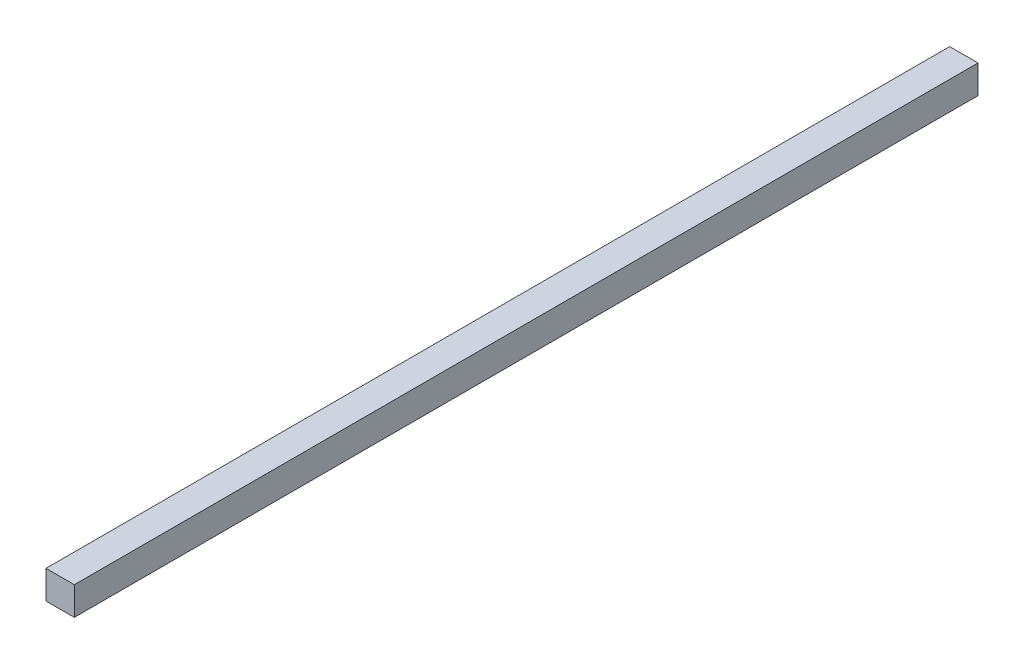
ISO-10303-21;
HEADER;
FILE_DESCRIPTION(('STEP AP214'),'2;1');
FILE_NAME('part.step','',(''),(''),'','','');
FILE_SCHEMA(('AUTOMOTIVE_DESIGN { 1 0 10303 214 1 1 1 1 }'));
ENDSEC;
DATA;
#1=APPLICATION_CONTEXT('core data for automotive mechanical design processes');
#2=APPLICATION_PROTOCOL_DEFINITION('international standard','automotive_design',2000,#1);
#3=PRODUCT_CONTEXT('',#1,'mechanical');
#4=PRODUCT('Part','Part','',(#3));
#5=PRODUCT_RELATED_PRODUCT_CATEGORY('part','',(#4));
#6=PRODUCT_DEFINITION_FORMATION('','',#4);
#7=PRODUCT_DEFINITION_CONTEXT('part definition',#1,'design');
#8=PRODUCT_DEFINITION('design','',#6,#7);
#9=PRODUCT_DEFINITION_SHAPE('','',#8);
#10=(LENGTH_UNIT() NAMED_UNIT(*) SI_UNIT(.MILLI.,.METRE.));
#11=(NAMED_UNIT(*) PLANE_ANGLE_UNIT() SI_UNIT($,.RADIAN.));
#12=(NAMED_UNIT(*) SI_UNIT($,.STERADIAN.) SOLID_ANGLE_UNIT());
#13=UNCERTAINTY_MEASURE_WITH_UNIT(LENGTH_MEASURE(1.E-05),#10,'distance_accuracy_value','');
#14=(GEOMETRIC_REPRESENTATION_CONTEXT(3) GLOBAL_UNCERTAINTY_ASSIGNED_CONTEXT((#13)) GLOBAL_UNIT_ASSIGNED_CONTEXT((#10,
#11,#12)) REPRESENTATION_CONTEXT('',''));
#15=CARTESIAN_POINT('',(0.,0.,0.));
#16=DIRECTION('',(0.,0.,1.));
#17=DIRECTION('',(1.,0.,0.));
#18=AXIS2_PLACEMENT_3D('',#15,#16,#17);
#19=CARTESIAN_POINT('',(0.,0.,-574.));
#20=DIRECTION('',(-1.,0.,0.));
#21=DIRECTION('',(0.,0.,1.));
#22=AXIS2_PLACEMENT_3D('',#19,#20,#21);
#23=PLANE('',#22);
#24=DIRECTION('',(0.,-1.,0.));
#25=VECTOR('',#24,1.);
#26=CARTESIAN_POINT('',(0.,0.,0.));
#27=LINE('',#26,#25);
#28=CARTESIAN_POINT('',(0.,18.,0.));
#29=VERTEX_POINT('',#28);
#30=CARTESIAN_POINT('',(0.,0.,0.));
#31=VERTEX_POINT('',#30);
#32=EDGE_CURVE('E95',#29,#31,#27,.T.);
#33=ORIENTED_EDGE('',*,*,#32,.F.);
#34=DIRECTION('',(0.,0.,1.));
#35=VECTOR('',#34,1.);
#36=CARTESIAN_POINT('',(0.,18.,-574.));
#37=LINE('',#36,#35);
#38=CARTESIAN_POINT('',(0.,18.,-574.));
#39=VERTEX_POINT('',#38);
#40=EDGE_CURVE('E11',#39,#29,#37,.T.);
#41=ORIENTED_EDGE('',*,*,#40,.F.);
#42=DIRECTION('',(0.,-1.,0.));
#43=VECTOR('',#42,1.);
#44=CARTESIAN_POINT('',(0.,0.,-574.));
#45=LINE('',#44,#43);
#46=CARTESIAN_POINT('',(0.,0.,-574.));
#47=VERTEX_POINT('',#46);
#48=EDGE_CURVE('E89',#39,#47,#45,.T.);
#49=ORIENTED_EDGE('',*,*,#48,.T.);
#50=DIRECTION('',(0.,0.,1.));
#51=VECTOR('',#50,1.);
#52=CARTESIAN_POINT('',(0.,0.,-574.));
#53=LINE('',#52,#51);
#54=EDGE_CURVE('E34',#47,#31,#53,.T.);
#55=ORIENTED_EDGE('',*,*,#54,.T.);
#56=EDGE_LOOP('',(#33,#41,#49,#55));
#57=FACE_BOUND('',#56,.T.);
#58=ADVANCED_FACE('F31',(#57),#23,.T.);
#59=CARTESIAN_POINT('',(0.,18.,-574.));
#60=DIRECTION('',(0.,1.,0.));
#61=DIRECTION('',(0.,0.,1.));
#62=AXIS2_PLACEMENT_3D('',#59,#60,#61);
#63=PLANE('',#62);
#64=DIRECTION('',(-1.,0.,0.));
#65=VECTOR('',#64,1.);
#66=CARTESIAN_POINT('',(0.,18.,0.));
#67=LINE('',#66,#65);
#68=CARTESIAN_POINT('',(18.,18.,0.));
#69=VERTEX_POINT('',#68);
#70=EDGE_CURVE('E91',#69,#29,#67,.T.);
#71=ORIENTED_EDGE('',*,*,#70,.F.);
#72=DIRECTION('',(0.,0.,1.));
#73=VECTOR('',#72,1.);
#74=CARTESIAN_POINT('',(18.,18.,-574.));
#75=LINE('',#74,#73);
#76=CARTESIAN_POINT('',(18.,18.,-574.));
#77=VERTEX_POINT('',#76);
#78=EDGE_CURVE('E40',#77,#69,#75,.T.);
#79=ORIENTED_EDGE('',*,*,#78,.F.);
#80=DIRECTION('',(-1.,0.,0.));
#81=VECTOR('',#80,1.);
#82=CARTESIAN_POINT('',(0.,18.,-574.));
#83=LINE('',#82,#81);
#84=EDGE_CURVE('E86',#77,#39,#83,.T.);
#85=ORIENTED_EDGE('',*,*,#84,.T.);
#86=ORIENTED_EDGE('',*,*,#40,.T.);
#87=EDGE_LOOP('',(#71,#79,#85,#86));
#88=FACE_BOUND('',#87,.T.);
#89=ADVANCED_FACE('F105',(#88),#63,.T.);
#90=CARTESIAN_POINT('',(18.,0.,-574.));
#91=DIRECTION('',(1.,0.,0.));
#92=DIRECTION('',(0.,0.,-1.));
#93=AXIS2_PLACEMENT_3D('',#90,#91,#92);
#94=PLANE('',#93);
#95=DIRECTION('',(0.,1.,0.));
#96=VECTOR('',#95,1.);
#97=CARTESIAN_POINT('',(18.,0.,0.));
#98=LINE('',#97,#96);
#99=CARTESIAN_POINT('',(18.,0.,0.));
#100=VERTEX_POINT('',#99);
#101=EDGE_CURVE('E81',#100,#69,#98,.T.);
#102=ORIENTED_EDGE('',*,*,#101,.F.);
#103=DIRECTION('',(0.,0.,1.));
#104=VECTOR('',#103,1.);
#105=CARTESIAN_POINT('',(18.,0.,-574.));
#106=LINE('',#105,#104);
#107=CARTESIAN_POINT('',(18.,0.,-574.));
#108=VERTEX_POINT('',#107);
#109=EDGE_CURVE('E76',#108,#100,#106,.T.);
#110=ORIENTED_EDGE('',*,*,#109,.F.);
#111=DIRECTION('',(0.,1.,0.));
#112=VECTOR('',#111,1.);
#113=CARTESIAN_POINT('',(18.,0.,-574.));
#114=LINE('',#113,#112);
#115=EDGE_CURVE('E79',#108,#77,#114,.T.);
#116=ORIENTED_EDGE('',*,*,#115,.T.);
#117=ORIENTED_EDGE('',*,*,#78,.T.);
#118=EDGE_LOOP('',(#102,#110,#116,#117));
#119=FACE_BOUND('',#118,.T.);
#120=ADVANCED_FACE('F78',(#119),#94,.T.);
#121=CARTESIAN_POINT('',(0.,0.,-574.));
#122=DIRECTION('',(0.,-1.,0.));
#123=DIRECTION('',(0.,0.,-1.));
#124=AXIS2_PLACEMENT_3D('',#121,#122,#123);
#125=PLANE('',#124);
#126=DIRECTION('',(1.,0.,0.));
#127=VECTOR('',#126,1.);
#128=CARTESIAN_POINT('',(0.,0.,0.));
#129=LINE('',#128,#127);
#130=EDGE_CURVE('E98',#31,#100,#129,.T.);
#131=ORIENTED_EDGE('',*,*,#130,.F.);
#132=ORIENTED_EDGE('',*,*,#54,.F.);
#133=DIRECTION('',(1.,0.,0.));
#134=VECTOR('',#133,1.);
#135=CARTESIAN_POINT('',(0.,0.,-574.));
#136=LINE('',#135,#134);
#137=EDGE_CURVE('E85',#47,#108,#136,.T.);
#138=ORIENTED_EDGE('',*,*,#137,.T.);
#139=ORIENTED_EDGE('',*,*,#109,.T.);
#140=EDGE_LOOP('',(#131,#132,#138,#139));
#141=FACE_BOUND('',#140,.T.);
#142=ADVANCED_FACE('F88',(#141),#125,.T.);
#143=CARTESIAN_POINT('',(0.,18.,-574.));
#144=DIRECTION('',(0.,0.,-1.));
#145=DIRECTION('',(-1.,0.,0.));
#146=AXIS2_PLACEMENT_3D('',#143,#144,#145);
#147=PLANE('',#146);
#148=ORIENTED_EDGE('',*,*,#48,.F.);
#149=ORIENTED_EDGE('',*,*,#84,.F.);
#150=ORIENTED_EDGE('',*,*,#115,.F.);
#151=ORIENTED_EDGE('',*,*,#137,.F.);
#152=EDGE_LOOP('',(#148,#149,#150,#151));
#153=FACE_BOUND('',#152,.T.);
#154=ADVANCED_FACE('F84',(#153),#147,.T.);
#155=CARTESIAN_POINT('',(0.,18.,0.));
#156=DIRECTION('',(0.,0.,-1.));
#157=DIRECTION('',(-1.,0.,0.));
#158=AXIS2_PLACEMENT_3D('',#155,#156,#157);
#159=PLANE('',#158);
#160=ORIENTED_EDGE('',*,*,#32,.T.);
#161=ORIENTED_EDGE('',*,*,#130,.T.);
#162=ORIENTED_EDGE('',*,*,#101,.T.);
#163=ORIENTED_EDGE('',*,*,#70,.T.);
#164=EDGE_LOOP('',(#160,#161,#162,#163));
#165=FACE_BOUND('',#164,.T.);
#166=ADVANCED_FACE('F104',(#165),#159,.F.);
#167=CLOSED_SHELL('',(#58,#89,#120,#142,#154,#166));
#168=MANIFOLD_SOLID_BREP('B2',#167);
#169=ADVANCED_BREP_SHAPE_REPRESENTATION('',(#18,#168),#14);
#170=SHAPE_DEFINITION_REPRESENTATION(#9,#169);
ENDSEC;
END-ISO-10303-21;
